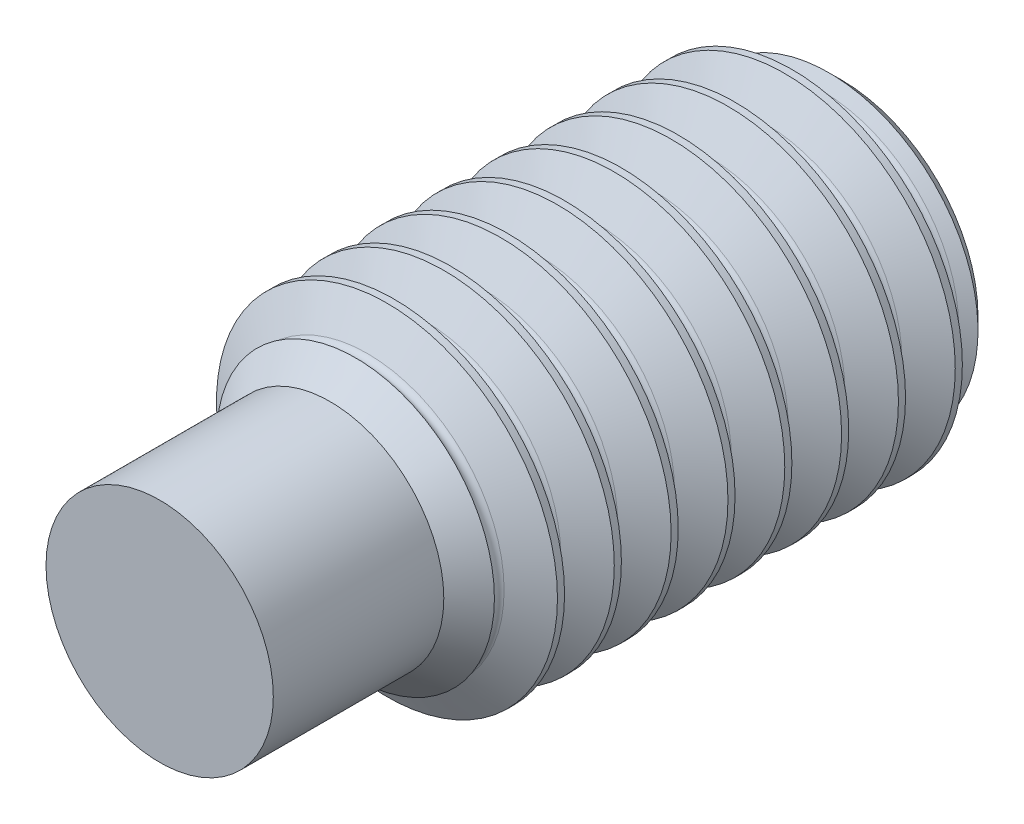
ISO-10303-21;
HEADER;
FILE_DESCRIPTION(('STEP AP214'),'2;1');
FILE_NAME('part.step','',(''),(''),'','','');
FILE_SCHEMA(('AUTOMOTIVE_DESIGN { 1 0 10303 214 1 1 1 1 }'));
ENDSEC;
DATA;
#1=APPLICATION_CONTEXT('core data for automotive mechanical design processes');
#2=APPLICATION_PROTOCOL_DEFINITION('international standard','automotive_design',2000,#1);
#3=PRODUCT_CONTEXT('',#1,'mechanical');
#4=PRODUCT('Part','Part','',(#3));
#5=PRODUCT_RELATED_PRODUCT_CATEGORY('part','',(#4));
#6=PRODUCT_DEFINITION_FORMATION('','',#4);
#7=PRODUCT_DEFINITION_CONTEXT('part definition',#1,'design');
#8=PRODUCT_DEFINITION('design','',#6,#7);
#9=PRODUCT_DEFINITION_SHAPE('','',#8);
#10=(LENGTH_UNIT() NAMED_UNIT(*) SI_UNIT(.MILLI.,.METRE.));
#11=(NAMED_UNIT(*) PLANE_ANGLE_UNIT() SI_UNIT($,.RADIAN.));
#12=(NAMED_UNIT(*) SI_UNIT($,.STERADIAN.) SOLID_ANGLE_UNIT());
#13=UNCERTAINTY_MEASURE_WITH_UNIT(LENGTH_MEASURE(1.E-05),#10,'distance_accuracy_value','');
#14=(GEOMETRIC_REPRESENTATION_CONTEXT(3) GLOBAL_UNCERTAINTY_ASSIGNED_CONTEXT((#13)) GLOBAL_UNIT_ASSIGNED_CONTEXT((#10,
#11,#12)) REPRESENTATION_CONTEXT('',''));
#15=CARTESIAN_POINT('',(0.,0.,0.));
#16=DIRECTION('',(0.,0.,1.));
#17=DIRECTION('',(1.,0.,0.));
#18=AXIS2_PLACEMENT_3D('',#15,#16,#17);
#19=CARTESIAN_POINT('',(0.,1.5,0.));
#20=DIRECTION('',(0.,0.,1.));
#21=DIRECTION('',(1.,0.,0.));
#22=AXIS2_PLACEMENT_3D('',#19,#20,#21);
#23=PLANE('',#22);
#24=CARTESIAN_POINT('',(0.,0.,0.));
#25=DIRECTION('',(0.,0.,1.));
#26=DIRECTION('',(0.,-1.,0.));
#27=AXIS2_PLACEMENT_3D('',#24,#25,#26);
#28=CIRCLE('',#27,1.2);
#29=CARTESIAN_POINT('',(0.,-1.2,0.));
#30=VERTEX_POINT('',#29);
#31=EDGE_CURVE('E11',#30,#30,#28,.T.);
#32=ORIENTED_EDGE('',*,*,#31,.F.);
#33=EDGE_LOOP('',(#32));
#34=FACE_BOUND('',#33,.T.);
#35=DIRECTION('',(-0.5,0.866025403784438,0.));
#36=VECTOR('',#35,1.);
#37=CARTESIAN_POINT('',(0.866025403784439,0.,0.));
#38=LINE('',#37,#36);
#39=CARTESIAN_POINT('',(0.866025403784439,0.,0.));
#40=VERTEX_POINT('',#39);
#41=CARTESIAN_POINT('',(0.433012701892219,0.75,0.));
#42=VERTEX_POINT('',#41);
#43=EDGE_CURVE('E52',#40,#42,#38,.T.);
#44=ORIENTED_EDGE('',*,*,#43,.T.);
#45=DIRECTION('',(-1.,0.,0.));
#46=VECTOR('',#45,1.);
#47=CARTESIAN_POINT('',(0.433012701892219,0.75,0.));
#48=LINE('',#47,#46);
#49=CARTESIAN_POINT('',(-0.433012701892219,0.75,0.));
#50=VERTEX_POINT('',#49);
#51=EDGE_CURVE('E129',#42,#50,#48,.T.);
#52=ORIENTED_EDGE('',*,*,#51,.T.);
#53=DIRECTION('',(-0.5,-0.866025403784439,0.));
#54=VECTOR('',#53,1.);
#55=CARTESIAN_POINT('',(-0.433012701892219,0.75,0.));
#56=LINE('',#55,#54);
#57=CARTESIAN_POINT('',(-0.866025403784439,0.,0.));
#58=VERTEX_POINT('',#57);
#59=EDGE_CURVE('E132',#50,#58,#56,.T.);
#60=ORIENTED_EDGE('',*,*,#59,.T.);
#61=DIRECTION('',(0.5,-0.866025403784438,0.));
#62=VECTOR('',#61,1.);
#63=CARTESIAN_POINT('',(-0.866025403784439,0.,0.));
#64=LINE('',#63,#62);
#65=CARTESIAN_POINT('',(-0.433012701892219,-0.75,0.));
#66=VERTEX_POINT('',#65);
#67=EDGE_CURVE('E135',#58,#66,#64,.T.);
#68=ORIENTED_EDGE('',*,*,#67,.T.);
#69=DIRECTION('',(1.,0.,0.));
#70=VECTOR('',#69,1.);
#71=CARTESIAN_POINT('',(-0.433012701892219,-0.75,0.));
#72=LINE('',#71,#70);
#73=CARTESIAN_POINT('',(0.43301270189222,-0.75,0.));
#74=VERTEX_POINT('',#73);
#75=EDGE_CURVE('E99',#66,#74,#72,.T.);
#76=ORIENTED_EDGE('',*,*,#75,.T.);
#77=DIRECTION('',(0.5,0.866025403784439,0.));
#78=VECTOR('',#77,1.);
#79=CARTESIAN_POINT('',(0.43301270189222,-0.75,0.));
#80=LINE('',#79,#78);
#81=EDGE_CURVE('E94',#74,#40,#80,.T.);
#82=ORIENTED_EDGE('',*,*,#81,.T.);
#83=EDGE_LOOP('',(#44,#52,#60,#68,#76,#82));
#84=FACE_BOUND('',#83,.T.);
#85=ADVANCED_FACE('F37',(#34,#84),#23,.F.);
#86=CARTESIAN_POINT('',(0.,0.,6.));
#87=DIRECTION('',(0.,0.,1.));
#88=DIRECTION('',(1.,0.,0.));
#89=AXIS2_PLACEMENT_3D('',#86,#87,#88);
#90=CYLINDRICAL_SURFACE('',#89,1.5);
#91=CARTESIAN_POINT('',(0.,0.,0.5));
#92=DIRECTION('',(0.,0.,1.));
#93=DIRECTION('',(1.,0.,0.));
#94=AXIS2_PLACEMENT_3D('',#91,#92,#93);
#95=CIRCLE('',#94,1.5);
#96=CARTESIAN_POINT('',(1.5,0.,0.5));
#97=VERTEX_POINT('',#96);
#98=EDGE_CURVE('E222',#97,#97,#95,.T.);
#99=ORIENTED_EDGE('',*,*,#98,.F.);
#100=EDGE_LOOP('',(#99));
#101=FACE_BOUND('',#100,.T.);
#102=CARTESIAN_POINT('',(0.,0.,0.4375));
#103=DIRECTION('',(0.,0.,1.));
#104=DIRECTION('',(1.,0.,0.));
#105=AXIS2_PLACEMENT_3D('',#102,#103,#104);
#106=CIRCLE('',#105,1.5);
#107=CARTESIAN_POINT('',(1.5,0.,0.4375));
#108=VERTEX_POINT('',#107);
#109=EDGE_CURVE('E234',#108,#108,#106,.T.);
#110=ORIENTED_EDGE('',*,*,#109,.T.);
#111=EDGE_LOOP('',(#110));
#112=FACE_BOUND('',#111,.T.);
#113=ADVANCED_FACE('F39',(#101,#112),#90,.T.);
#114=CARTESIAN_POINT('',(0.,0.,0.));
#115=DIRECTION('',(0.,0.,-1.));
#116=DIRECTION('',(-1.,0.,0.));
#117=AXIS2_PLACEMENT_3D('',#114,#115,#116);
#118=CONICAL_SURFACE('',#117,1.5,1.04719755119659);
#119=CARTESIAN_POINT('',(0.,0.,0.171875));
#120=DIRECTION('',(0.,0.,1.));
#121=DIRECTION('',(1.,0.,0.));
#122=AXIS2_PLACEMENT_3D('',#119,#120,#121);
#123=CIRCLE('',#122,1.2023037674491);
#124=CARTESIAN_POINT('',(1.2023037674491,0.,0.171875));
#125=VERTEX_POINT('',#124);
#126=EDGE_CURVE('E231',#125,#125,#123,.T.);
#127=ORIENTED_EDGE('',*,*,#126,.F.);
#128=EDGE_LOOP('',(#127));
#129=FACE_BOUND('',#128,.T.);
#130=CARTESIAN_POINT('',(0.,0.,0.109807621135332));
#131=DIRECTION('',(0.,0.,-1.));
#132=DIRECTION('',(-1.,0.,0.));
#133=AXIS2_PLACEMENT_3D('',#130,#131,#132);
#134=CIRCLE('',#133,1.30980762113533);
#135=CARTESIAN_POINT('',(-1.30980762113533,0.,0.109807621135332));
#136=VERTEX_POINT('',#135);
#137=EDGE_CURVE('E41',#136,#136,#134,.T.);
#138=ORIENTED_EDGE('',*,*,#137,.F.);
#139=EDGE_LOOP('',(#138));
#140=FACE_BOUND('',#139,.T.);
#141=ADVANCED_FACE('F244',(#129,#140),#118,.T.);
#142=CARTESIAN_POINT('',(0.,0.,0.265625));
#143=DIRECTION('',(0.,0.,1.));
#144=DIRECTION('',(1.,0.,0.));
#145=AXIS2_PLACEMENT_3D('',#142,#143,#144);
#146=CONICAL_SURFACE('',#145,1.2023037674491,1.04719755119659);
#147=ORIENTED_EDGE('',*,*,#109,.F.);
#148=EDGE_LOOP('',(#147));
#149=FACE_BOUND('',#148,.T.);
#150=CARTESIAN_POINT('',(0.,0.,0.265625));
#151=DIRECTION('',(0.,0.,1.));
#152=DIRECTION('',(1.,0.,0.));
#153=AXIS2_PLACEMENT_3D('',#150,#151,#152);
#154=CIRCLE('',#153,1.2023037674491);
#155=CARTESIAN_POINT('',(1.2023037674491,0.,0.265625));
#156=VERTEX_POINT('',#155);
#157=EDGE_CURVE('E228',#156,#156,#154,.T.);
#158=ORIENTED_EDGE('',*,*,#157,.T.);
#159=EDGE_LOOP('',(#158));
#160=FACE_BOUND('',#159,.T.);
#161=ADVANCED_FACE('F246',(#149,#160),#146,.T.);
#162=CARTESIAN_POINT('',(0.,0.,0.21875));
#163=DIRECTION('',(0.,0.,1.));
#164=DIRECTION('',(1.,0.,0.));
#165=AXIS2_PLACEMENT_3D('',#162,#163,#164);
#166=TOROIDAL_SURFACE('',#165,1.22936706131736,0.0541265877365273);
#167=ORIENTED_EDGE('',*,*,#157,.F.);
#168=EDGE_LOOP('',(#167));
#169=FACE_BOUND('',#168,.T.);
#170=ORIENTED_EDGE('',*,*,#126,.T.);
#171=EDGE_LOOP('',(#170));
#172=FACE_BOUND('',#171,.T.);
#173=ADVANCED_FACE('F253',(#169,#172),#166,.F.);
#174=CARTESIAN_POINT('',(0.,0.,0.));
#175=DIRECTION('',(0.,0.,1.));
#176=DIRECTION('',(0.,-1.,0.));
#177=AXIS2_PLACEMENT_3D('',#174,#175,#176);
#178=CONICAL_SURFACE('',#177,1.2,0.785398163397442);
#179=ORIENTED_EDGE('',*,*,#137,.T.);
#180=EDGE_LOOP('',(#179));
#181=FACE_BOUND('',#180,.T.);
#182=ORIENTED_EDGE('',*,*,#31,.T.);
#183=EDGE_LOOP('',(#182));
#184=FACE_BOUND('',#183,.T.);
#185=ADVANCED_FACE('F241',(#181,#184),#178,.T.);
#186=CARTESIAN_POINT('',(0.,0.,0.765625));
#187=DIRECTION('',(0.,0.,1.));
#188=DIRECTION('',(1.,0.,0.));
#189=AXIS2_PLACEMENT_3D('',#186,#187,#188);
#190=CONICAL_SURFACE('',#189,1.2023037674491,1.04719755119659);
#191=CARTESIAN_POINT('',(0.,0.,0.9375));
#192=DIRECTION('',(0.,0.,1.));
#193=DIRECTION('',(1.,0.,0.));
#194=AXIS2_PLACEMENT_3D('',#191,#192,#193);
#195=CIRCLE('',#194,1.5);
#196=CARTESIAN_POINT('',(1.5,0.,0.9375));
#197=VERTEX_POINT('',#196);
#198=EDGE_CURVE('E225',#197,#197,#195,.T.);
#199=ORIENTED_EDGE('',*,*,#198,.F.);
#200=EDGE_LOOP('',(#199));
#201=FACE_BOUND('',#200,.T.);
#202=CARTESIAN_POINT('',(0.,0.,0.765625));
#203=DIRECTION('',(0.,0.,1.));
#204=DIRECTION('',(1.,0.,0.));
#205=AXIS2_PLACEMENT_3D('',#202,#203,#204);
#206=CIRCLE('',#205,1.2023037674491);
#207=CARTESIAN_POINT('',(1.2023037674491,0.,0.765625));
#208=VERTEX_POINT('',#207);
#209=EDGE_CURVE('E216',#208,#208,#206,.T.);
#210=ORIENTED_EDGE('',*,*,#209,.T.);
#211=EDGE_LOOP('',(#210));
#212=FACE_BOUND('',#211,.T.);
#213=ADVANCED_FACE('F274',(#201,#212),#190,.T.);
#214=CARTESIAN_POINT('',(0.,0.,0.5));
#215=DIRECTION('',(0.,0.,-1.));
#216=DIRECTION('',(-1.,0.,0.));
#217=AXIS2_PLACEMENT_3D('',#214,#215,#216);
#218=CONICAL_SURFACE('',#217,1.5,1.04719755119659);
#219=CARTESIAN_POINT('',(0.,0.,0.671875));
#220=DIRECTION('',(0.,0.,1.));
#221=DIRECTION('',(1.,0.,0.));
#222=AXIS2_PLACEMENT_3D('',#219,#220,#221);
#223=CIRCLE('',#222,1.2023037674491);
#224=CARTESIAN_POINT('',(1.2023037674491,0.,0.671875));
#225=VERTEX_POINT('',#224);
#226=EDGE_CURVE('E219',#225,#225,#223,.T.);
#227=ORIENTED_EDGE('',*,*,#226,.F.);
#228=EDGE_LOOP('',(#227));
#229=FACE_BOUND('',#228,.T.);
#230=ORIENTED_EDGE('',*,*,#98,.T.);
#231=EDGE_LOOP('',(#230));
#232=FACE_BOUND('',#231,.T.);
#233=ADVANCED_FACE('F279',(#229,#232),#218,.T.);
#234=CARTESIAN_POINT('',(0.,0.,0.71875));
#235=DIRECTION('',(0.,0.,1.));
#236=DIRECTION('',(1.,0.,0.));
#237=AXIS2_PLACEMENT_3D('',#234,#235,#236);
#238=TOROIDAL_SURFACE('',#237,1.22936706131736,0.0541265877365273);
#239=ORIENTED_EDGE('',*,*,#209,.F.);
#240=EDGE_LOOP('',(#239));
#241=FACE_BOUND('',#240,.T.);
#242=ORIENTED_EDGE('',*,*,#226,.T.);
#243=EDGE_LOOP('',(#242));
#244=FACE_BOUND('',#243,.T.);
#245=ADVANCED_FACE('F290',(#241,#244),#238,.F.);
#246=CARTESIAN_POINT('',(0.,0.,1.));
#247=DIRECTION('',(0.,0.,1.));
#248=DIRECTION('',(1.,0.,0.));
#249=AXIS2_PLACEMENT_3D('',#246,#247,#248);
#250=CIRCLE('',#249,1.5);
#251=CARTESIAN_POINT('',(1.5,0.,1.));
#252=VERTEX_POINT('',#251);
#253=EDGE_CURVE('E210',#252,#252,#250,.T.);
#254=ORIENTED_EDGE('',*,*,#253,.F.);
#255=EDGE_LOOP('',(#254));
#256=FACE_BOUND('',#255,.T.);
#257=ORIENTED_EDGE('',*,*,#198,.T.);
#258=EDGE_LOOP('',(#257));
#259=FACE_BOUND('',#258,.T.);
#260=ADVANCED_FACE('F258',(#256,#259),#90,.T.);
#261=CARTESIAN_POINT('',(0.,0.,1.265625));
#262=DIRECTION('',(0.,0.,1.));
#263=DIRECTION('',(1.,0.,0.));
#264=AXIS2_PLACEMENT_3D('',#261,#262,#263);
#265=CONICAL_SURFACE('',#264,1.2023037674491,1.04719755119659);
#266=CARTESIAN_POINT('',(0.,0.,1.4375));
#267=DIRECTION('',(0.,0.,1.));
#268=DIRECTION('',(1.,0.,0.));
#269=AXIS2_PLACEMENT_3D('',#266,#267,#268);
#270=CIRCLE('',#269,1.5);
#271=CARTESIAN_POINT('',(1.5,0.,1.4375));
#272=VERTEX_POINT('',#271);
#273=EDGE_CURVE('E213',#272,#272,#270,.T.);
#274=ORIENTED_EDGE('',*,*,#273,.F.);
#275=EDGE_LOOP('',(#274));
#276=FACE_BOUND('',#275,.T.);
#277=CARTESIAN_POINT('',(0.,0.,1.265625));
#278=DIRECTION('',(0.,0.,1.));
#279=DIRECTION('',(1.,0.,0.));
#280=AXIS2_PLACEMENT_3D('',#277,#278,#279);
#281=CIRCLE('',#280,1.2023037674491);
#282=CARTESIAN_POINT('',(1.2023037674491,0.,1.265625));
#283=VERTEX_POINT('',#282);
#284=EDGE_CURVE('E204',#283,#283,#281,.T.);
#285=ORIENTED_EDGE('',*,*,#284,.T.);
#286=EDGE_LOOP('',(#285));
#287=FACE_BOUND('',#286,.T.);
#288=ADVANCED_FACE('F295',(#276,#287),#265,.T.);
#289=CARTESIAN_POINT('',(0.,0.,1.));
#290=DIRECTION('',(0.,0.,-1.));
#291=DIRECTION('',(-1.,0.,0.));
#292=AXIS2_PLACEMENT_3D('',#289,#290,#291);
#293=CONICAL_SURFACE('',#292,1.5,1.04719755119659);
#294=CARTESIAN_POINT('',(0.,0.,1.171875));
#295=DIRECTION('',(0.,0.,1.));
#296=DIRECTION('',(1.,0.,0.));
#297=AXIS2_PLACEMENT_3D('',#294,#295,#296);
#298=CIRCLE('',#297,1.2023037674491);
#299=CARTESIAN_POINT('',(1.2023037674491,0.,1.171875));
#300=VERTEX_POINT('',#299);
#301=EDGE_CURVE('E207',#300,#300,#298,.T.);
#302=ORIENTED_EDGE('',*,*,#301,.F.);
#303=EDGE_LOOP('',(#302));
#304=FACE_BOUND('',#303,.T.);
#305=ORIENTED_EDGE('',*,*,#253,.T.);
#306=EDGE_LOOP('',(#305));
#307=FACE_BOUND('',#306,.T.);
#308=ADVANCED_FACE('F298',(#304,#307),#293,.T.);
#309=CARTESIAN_POINT('',(0.,0.,1.21875));
#310=DIRECTION('',(0.,0.,1.));
#311=DIRECTION('',(1.,0.,0.));
#312=AXIS2_PLACEMENT_3D('',#309,#310,#311);
#313=TOROIDAL_SURFACE('',#312,1.22936706131736,0.0541265877365273);
#314=ORIENTED_EDGE('',*,*,#284,.F.);
#315=EDGE_LOOP('',(#314));
#316=FACE_BOUND('',#315,.T.);
#317=ORIENTED_EDGE('',*,*,#301,.T.);
#318=EDGE_LOOP('',(#317));
#319=FACE_BOUND('',#318,.T.);
#320=ADVANCED_FACE('F302',(#316,#319),#313,.F.);
#321=CARTESIAN_POINT('',(0.,0.,1.5));
#322=DIRECTION('',(0.,0.,1.));
#323=DIRECTION('',(1.,0.,0.));
#324=AXIS2_PLACEMENT_3D('',#321,#322,#323);
#325=CIRCLE('',#324,1.5);
#326=CARTESIAN_POINT('',(1.5,0.,1.5));
#327=VERTEX_POINT('',#326);
#328=EDGE_CURVE('E198',#327,#327,#325,.T.);
#329=ORIENTED_EDGE('',*,*,#328,.F.);
#330=EDGE_LOOP('',(#329));
#331=FACE_BOUND('',#330,.T.);
#332=ORIENTED_EDGE('',*,*,#273,.T.);
#333=EDGE_LOOP('',(#332));
#334=FACE_BOUND('',#333,.T.);
#335=ADVANCED_FACE('F306',(#331,#334),#90,.T.);
#336=CARTESIAN_POINT('',(0.,0.,1.765625));
#337=DIRECTION('',(0.,0.,1.));
#338=DIRECTION('',(1.,0.,0.));
#339=AXIS2_PLACEMENT_3D('',#336,#337,#338);
#340=CONICAL_SURFACE('',#339,1.2023037674491,1.04719755119659);
#341=CARTESIAN_POINT('',(0.,0.,1.9375));
#342=DIRECTION('',(0.,0.,1.));
#343=DIRECTION('',(1.,0.,0.));
#344=AXIS2_PLACEMENT_3D('',#341,#342,#343);
#345=CIRCLE('',#344,1.5);
#346=CARTESIAN_POINT('',(1.5,0.,1.9375));
#347=VERTEX_POINT('',#346);
#348=EDGE_CURVE('E201',#347,#347,#345,.T.);
#349=ORIENTED_EDGE('',*,*,#348,.F.);
#350=EDGE_LOOP('',(#349));
#351=FACE_BOUND('',#350,.T.);
#352=CARTESIAN_POINT('',(0.,0.,1.765625));
#353=DIRECTION('',(0.,0.,1.));
#354=DIRECTION('',(1.,0.,0.));
#355=AXIS2_PLACEMENT_3D('',#352,#353,#354);
#356=CIRCLE('',#355,1.2023037674491);
#357=CARTESIAN_POINT('',(1.2023037674491,0.,1.765625));
#358=VERTEX_POINT('',#357);
#359=EDGE_CURVE('E192',#358,#358,#356,.T.);
#360=ORIENTED_EDGE('',*,*,#359,.T.);
#361=EDGE_LOOP('',(#360));
#362=FACE_BOUND('',#361,.T.);
#363=ADVANCED_FACE('F308',(#351,#362),#340,.T.);
#364=CARTESIAN_POINT('',(0.,0.,1.5));
#365=DIRECTION('',(0.,0.,-1.));
#366=DIRECTION('',(-1.,0.,0.));
#367=AXIS2_PLACEMENT_3D('',#364,#365,#366);
#368=CONICAL_SURFACE('',#367,1.5,1.04719755119659);
#369=CARTESIAN_POINT('',(0.,0.,1.671875));
#370=DIRECTION('',(0.,0.,1.));
#371=DIRECTION('',(1.,0.,0.));
#372=AXIS2_PLACEMENT_3D('',#369,#370,#371);
#373=CIRCLE('',#372,1.2023037674491);
#374=CARTESIAN_POINT('',(1.2023037674491,0.,1.671875));
#375=VERTEX_POINT('',#374);
#376=EDGE_CURVE('E195',#375,#375,#373,.T.);
#377=ORIENTED_EDGE('',*,*,#376,.F.);
#378=EDGE_LOOP('',(#377));
#379=FACE_BOUND('',#378,.T.);
#380=ORIENTED_EDGE('',*,*,#328,.T.);
#381=EDGE_LOOP('',(#380));
#382=FACE_BOUND('',#381,.T.);
#383=ADVANCED_FACE('F311',(#379,#382),#368,.T.);
#384=CARTESIAN_POINT('',(0.,0.,1.71875));
#385=DIRECTION('',(0.,0.,1.));
#386=DIRECTION('',(1.,0.,0.));
#387=AXIS2_PLACEMENT_3D('',#384,#385,#386);
#388=TOROIDAL_SURFACE('',#387,1.22936706131736,0.0541265877365273);
#389=ORIENTED_EDGE('',*,*,#359,.F.);
#390=EDGE_LOOP('',(#389));
#391=FACE_BOUND('',#390,.T.);
#392=ORIENTED_EDGE('',*,*,#376,.T.);
#393=EDGE_LOOP('',(#392));
#394=FACE_BOUND('',#393,.T.);
#395=ADVANCED_FACE('F315',(#391,#394),#388,.F.);
#396=CARTESIAN_POINT('',(0.,0.,2.));
#397=DIRECTION('',(0.,0.,1.));
#398=DIRECTION('',(1.,0.,0.));
#399=AXIS2_PLACEMENT_3D('',#396,#397,#398);
#400=CIRCLE('',#399,1.5);
#401=CARTESIAN_POINT('',(1.5,0.,2.));
#402=VERTEX_POINT('',#401);
#403=EDGE_CURVE('E186',#402,#402,#400,.T.);
#404=ORIENTED_EDGE('',*,*,#403,.F.);
#405=EDGE_LOOP('',(#404));
#406=FACE_BOUND('',#405,.T.);
#407=ORIENTED_EDGE('',*,*,#348,.T.);
#408=EDGE_LOOP('',(#407));
#409=FACE_BOUND('',#408,.T.);
#410=ADVANCED_FACE('F319',(#406,#409),#90,.T.);
#411=CARTESIAN_POINT('',(0.,0.,2.265625));
#412=DIRECTION('',(0.,0.,1.));
#413=DIRECTION('',(1.,0.,0.));
#414=AXIS2_PLACEMENT_3D('',#411,#412,#413);
#415=CONICAL_SURFACE('',#414,1.2023037674491,1.04719755119659);
#416=CARTESIAN_POINT('',(0.,0.,2.4375));
#417=DIRECTION('',(0.,0.,1.));
#418=DIRECTION('',(1.,0.,0.));
#419=AXIS2_PLACEMENT_3D('',#416,#417,#418);
#420=CIRCLE('',#419,1.5);
#421=CARTESIAN_POINT('',(1.5,0.,2.4375));
#422=VERTEX_POINT('',#421);
#423=EDGE_CURVE('E189',#422,#422,#420,.T.);
#424=ORIENTED_EDGE('',*,*,#423,.F.);
#425=EDGE_LOOP('',(#424));
#426=FACE_BOUND('',#425,.T.);
#427=CARTESIAN_POINT('',(0.,0.,2.265625));
#428=DIRECTION('',(0.,0.,1.));
#429=DIRECTION('',(1.,0.,0.));
#430=AXIS2_PLACEMENT_3D('',#427,#428,#429);
#431=CIRCLE('',#430,1.2023037674491);
#432=CARTESIAN_POINT('',(1.2023037674491,0.,2.265625));
#433=VERTEX_POINT('',#432);
#434=EDGE_CURVE('E180',#433,#433,#431,.T.);
#435=ORIENTED_EDGE('',*,*,#434,.T.);
#436=EDGE_LOOP('',(#435));
#437=FACE_BOUND('',#436,.T.);
#438=ADVANCED_FACE('F321',(#426,#437),#415,.T.);
#439=CARTESIAN_POINT('',(0.,0.,2.));
#440=DIRECTION('',(0.,0.,-1.));
#441=DIRECTION('',(-1.,0.,0.));
#442=AXIS2_PLACEMENT_3D('',#439,#440,#441);
#443=CONICAL_SURFACE('',#442,1.5,1.04719755119659);
#444=CARTESIAN_POINT('',(0.,0.,2.171875));
#445=DIRECTION('',(0.,0.,1.));
#446=DIRECTION('',(1.,0.,0.));
#447=AXIS2_PLACEMENT_3D('',#444,#445,#446);
#448=CIRCLE('',#447,1.2023037674491);
#449=CARTESIAN_POINT('',(1.2023037674491,0.,2.171875));
#450=VERTEX_POINT('',#449);
#451=EDGE_CURVE('E183',#450,#450,#448,.T.);
#452=ORIENTED_EDGE('',*,*,#451,.F.);
#453=EDGE_LOOP('',(#452));
#454=FACE_BOUND('',#453,.T.);
#455=ORIENTED_EDGE('',*,*,#403,.T.);
#456=EDGE_LOOP('',(#455));
#457=FACE_BOUND('',#456,.T.);
#458=ADVANCED_FACE('F324',(#454,#457),#443,.T.);
#459=CARTESIAN_POINT('',(0.,0.,2.21875));
#460=DIRECTION('',(0.,0.,1.));
#461=DIRECTION('',(1.,0.,0.));
#462=AXIS2_PLACEMENT_3D('',#459,#460,#461);
#463=TOROIDAL_SURFACE('',#462,1.22936706131736,0.0541265877365273);
#464=ORIENTED_EDGE('',*,*,#434,.F.);
#465=EDGE_LOOP('',(#464));
#466=FACE_BOUND('',#465,.T.);
#467=ORIENTED_EDGE('',*,*,#451,.T.);
#468=EDGE_LOOP('',(#467));
#469=FACE_BOUND('',#468,.T.);
#470=ADVANCED_FACE('F328',(#466,#469),#463,.F.);
#471=CARTESIAN_POINT('',(0.,0.,2.5));
#472=DIRECTION('',(0.,0.,1.));
#473=DIRECTION('',(1.,0.,0.));
#474=AXIS2_PLACEMENT_3D('',#471,#472,#473);
#475=CIRCLE('',#474,1.5);
#476=CARTESIAN_POINT('',(1.5,0.,2.5));
#477=VERTEX_POINT('',#476);
#478=EDGE_CURVE('E174',#477,#477,#475,.T.);
#479=ORIENTED_EDGE('',*,*,#478,.F.);
#480=EDGE_LOOP('',(#479));
#481=FACE_BOUND('',#480,.T.);
#482=ORIENTED_EDGE('',*,*,#423,.T.);
#483=EDGE_LOOP('',(#482));
#484=FACE_BOUND('',#483,.T.);
#485=ADVANCED_FACE('F332',(#481,#484),#90,.T.);
#486=CARTESIAN_POINT('',(0.,0.,2.765625));
#487=DIRECTION('',(0.,0.,1.));
#488=DIRECTION('',(1.,0.,0.));
#489=AXIS2_PLACEMENT_3D('',#486,#487,#488);
#490=CONICAL_SURFACE('',#489,1.2023037674491,1.04719755119659);
#491=CARTESIAN_POINT('',(0.,0.,2.9375));
#492=DIRECTION('',(0.,0.,1.));
#493=DIRECTION('',(1.,0.,0.));
#494=AXIS2_PLACEMENT_3D('',#491,#492,#493);
#495=CIRCLE('',#494,1.5);
#496=CARTESIAN_POINT('',(1.5,0.,2.9375));
#497=VERTEX_POINT('',#496);
#498=EDGE_CURVE('E177',#497,#497,#495,.T.);
#499=ORIENTED_EDGE('',*,*,#498,.F.);
#500=EDGE_LOOP('',(#499));
#501=FACE_BOUND('',#500,.T.);
#502=CARTESIAN_POINT('',(0.,0.,2.765625));
#503=DIRECTION('',(0.,0.,1.));
#504=DIRECTION('',(1.,0.,0.));
#505=AXIS2_PLACEMENT_3D('',#502,#503,#504);
#506=CIRCLE('',#505,1.2023037674491);
#507=CARTESIAN_POINT('',(1.2023037674491,0.,2.765625));
#508=VERTEX_POINT('',#507);
#509=EDGE_CURVE('E168',#508,#508,#506,.T.);
#510=ORIENTED_EDGE('',*,*,#509,.T.);
#511=EDGE_LOOP('',(#510));
#512=FACE_BOUND('',#511,.T.);
#513=ADVANCED_FACE('F334',(#501,#512),#490,.T.);
#514=CARTESIAN_POINT('',(0.,0.,2.5));
#515=DIRECTION('',(0.,0.,-1.));
#516=DIRECTION('',(-1.,0.,0.));
#517=AXIS2_PLACEMENT_3D('',#514,#515,#516);
#518=CONICAL_SURFACE('',#517,1.5,1.04719755119659);
#519=CARTESIAN_POINT('',(0.,0.,2.671875));
#520=DIRECTION('',(0.,0.,1.));
#521=DIRECTION('',(1.,0.,0.));
#522=AXIS2_PLACEMENT_3D('',#519,#520,#521);
#523=CIRCLE('',#522,1.2023037674491);
#524=CARTESIAN_POINT('',(1.2023037674491,0.,2.671875));
#525=VERTEX_POINT('',#524);
#526=EDGE_CURVE('E171',#525,#525,#523,.T.);
#527=ORIENTED_EDGE('',*,*,#526,.F.);
#528=EDGE_LOOP('',(#527));
#529=FACE_BOUND('',#528,.T.);
#530=ORIENTED_EDGE('',*,*,#478,.T.);
#531=EDGE_LOOP('',(#530));
#532=FACE_BOUND('',#531,.T.);
#533=ADVANCED_FACE('F337',(#529,#532),#518,.T.);
#534=CARTESIAN_POINT('',(0.,0.,2.71875));
#535=DIRECTION('',(0.,0.,1.));
#536=DIRECTION('',(1.,0.,0.));
#537=AXIS2_PLACEMENT_3D('',#534,#535,#536);
#538=TOROIDAL_SURFACE('',#537,1.22936706131736,0.0541265877365273);
#539=ORIENTED_EDGE('',*,*,#509,.F.);
#540=EDGE_LOOP('',(#539));
#541=FACE_BOUND('',#540,.T.);
#542=ORIENTED_EDGE('',*,*,#526,.T.);
#543=EDGE_LOOP('',(#542));
#544=FACE_BOUND('',#543,.T.);
#545=ADVANCED_FACE('F341',(#541,#544),#538,.F.);
#546=CARTESIAN_POINT('',(0.,0.,3.));
#547=DIRECTION('',(0.,0.,1.));
#548=DIRECTION('',(1.,0.,0.));
#549=AXIS2_PLACEMENT_3D('',#546,#547,#548);
#550=CIRCLE('',#549,1.5);
#551=CARTESIAN_POINT('',(1.5,0.,3.));
#552=VERTEX_POINT('',#551);
#553=EDGE_CURVE('E162',#552,#552,#550,.T.);
#554=ORIENTED_EDGE('',*,*,#553,.F.);
#555=EDGE_LOOP('',(#554));
#556=FACE_BOUND('',#555,.T.);
#557=ORIENTED_EDGE('',*,*,#498,.T.);
#558=EDGE_LOOP('',(#557));
#559=FACE_BOUND('',#558,.T.);
#560=ADVANCED_FACE('F345',(#556,#559),#90,.T.);
#561=CARTESIAN_POINT('',(0.,0.,3.265625));
#562=DIRECTION('',(0.,0.,1.));
#563=DIRECTION('',(1.,0.,0.));
#564=AXIS2_PLACEMENT_3D('',#561,#562,#563);
#565=CONICAL_SURFACE('',#564,1.2023037674491,1.04719755119659);
#566=CARTESIAN_POINT('',(0.,0.,3.4375));
#567=DIRECTION('',(0.,0.,1.));
#568=DIRECTION('',(1.,0.,0.));
#569=AXIS2_PLACEMENT_3D('',#566,#567,#568);
#570=CIRCLE('',#569,1.5);
#571=CARTESIAN_POINT('',(1.5,0.,3.4375));
#572=VERTEX_POINT('',#571);
#573=EDGE_CURVE('E165',#572,#572,#570,.T.);
#574=ORIENTED_EDGE('',*,*,#573,.F.);
#575=EDGE_LOOP('',(#574));
#576=FACE_BOUND('',#575,.T.);
#577=CARTESIAN_POINT('',(0.,0.,3.265625));
#578=DIRECTION('',(0.,0.,1.));
#579=DIRECTION('',(1.,0.,0.));
#580=AXIS2_PLACEMENT_3D('',#577,#578,#579);
#581=CIRCLE('',#580,1.2023037674491);
#582=CARTESIAN_POINT('',(1.2023037674491,0.,3.265625));
#583=VERTEX_POINT('',#582);
#584=EDGE_CURVE('E156',#583,#583,#581,.T.);
#585=ORIENTED_EDGE('',*,*,#584,.T.);
#586=EDGE_LOOP('',(#585));
#587=FACE_BOUND('',#586,.T.);
#588=ADVANCED_FACE('F347',(#576,#587),#565,.T.);
#589=CARTESIAN_POINT('',(0.,0.,3.));
#590=DIRECTION('',(0.,0.,-1.));
#591=DIRECTION('',(-1.,0.,0.));
#592=AXIS2_PLACEMENT_3D('',#589,#590,#591);
#593=CONICAL_SURFACE('',#592,1.5,1.04719755119659);
#594=CARTESIAN_POINT('',(0.,0.,3.171875));
#595=DIRECTION('',(0.,0.,1.));
#596=DIRECTION('',(1.,0.,0.));
#597=AXIS2_PLACEMENT_3D('',#594,#595,#596);
#598=CIRCLE('',#597,1.2023037674491);
#599=CARTESIAN_POINT('',(1.2023037674491,0.,3.171875));
#600=VERTEX_POINT('',#599);
#601=EDGE_CURVE('E159',#600,#600,#598,.T.);
#602=ORIENTED_EDGE('',*,*,#601,.F.);
#603=EDGE_LOOP('',(#602));
#604=FACE_BOUND('',#603,.T.);
#605=ORIENTED_EDGE('',*,*,#553,.T.);
#606=EDGE_LOOP('',(#605));
#607=FACE_BOUND('',#606,.T.);
#608=ADVANCED_FACE('F350',(#604,#607),#593,.T.);
#609=CARTESIAN_POINT('',(0.,0.,3.21875));
#610=DIRECTION('',(0.,0.,1.));
#611=DIRECTION('',(1.,0.,0.));
#612=AXIS2_PLACEMENT_3D('',#609,#610,#611);
#613=TOROIDAL_SURFACE('',#612,1.22936706131736,0.0541265877365273);
#614=ORIENTED_EDGE('',*,*,#584,.F.);
#615=EDGE_LOOP('',(#614));
#616=FACE_BOUND('',#615,.T.);
#617=ORIENTED_EDGE('',*,*,#601,.T.);
#618=EDGE_LOOP('',(#617));
#619=FACE_BOUND('',#618,.T.);
#620=ADVANCED_FACE('F354',(#616,#619),#613,.F.);
#621=CARTESIAN_POINT('',(0.,0.,3.5));
#622=DIRECTION('',(0.,0.,1.));
#623=DIRECTION('',(1.,0.,0.));
#624=AXIS2_PLACEMENT_3D('',#621,#622,#623);
#625=CIRCLE('',#624,1.5);
#626=CARTESIAN_POINT('',(1.5,0.,3.5));
#627=VERTEX_POINT('',#626);
#628=EDGE_CURVE('E150',#627,#627,#625,.T.);
#629=ORIENTED_EDGE('',*,*,#628,.F.);
#630=EDGE_LOOP('',(#629));
#631=FACE_BOUND('',#630,.T.);
#632=ORIENTED_EDGE('',*,*,#573,.T.);
#633=EDGE_LOOP('',(#632));
#634=FACE_BOUND('',#633,.T.);
#635=ADVANCED_FACE('F358',(#631,#634),#90,.T.);
#636=CARTESIAN_POINT('',(0.,0.,3.765625));
#637=DIRECTION('',(0.,0.,1.));
#638=DIRECTION('',(1.,0.,0.));
#639=AXIS2_PLACEMENT_3D('',#636,#637,#638);
#640=CONICAL_SURFACE('',#639,1.2023037674491,1.04719755119659);
#641=CARTESIAN_POINT('',(0.,0.,3.9375));
#642=DIRECTION('',(0.,0.,1.));
#643=DIRECTION('',(1.,0.,0.));
#644=AXIS2_PLACEMENT_3D('',#641,#642,#643);
#645=CIRCLE('',#644,1.5);
#646=CARTESIAN_POINT('',(1.5,0.,3.9375));
#647=VERTEX_POINT('',#646);
#648=EDGE_CURVE('E153',#647,#647,#645,.T.);
#649=ORIENTED_EDGE('',*,*,#648,.F.);
#650=EDGE_LOOP('',(#649));
#651=FACE_BOUND('',#650,.T.);
#652=CARTESIAN_POINT('',(0.,0.,3.765625));
#653=DIRECTION('',(0.,0.,1.));
#654=DIRECTION('',(1.,0.,0.));
#655=AXIS2_PLACEMENT_3D('',#652,#653,#654);
#656=CIRCLE('',#655,1.2023037674491);
#657=CARTESIAN_POINT('',(1.2023037674491,0.,3.765625));
#658=VERTEX_POINT('',#657);
#659=EDGE_CURVE('E144',#658,#658,#656,.T.);
#660=ORIENTED_EDGE('',*,*,#659,.T.);
#661=EDGE_LOOP('',(#660));
#662=FACE_BOUND('',#661,.T.);
#663=ADVANCED_FACE('F360',(#651,#662),#640,.T.);
#664=CARTESIAN_POINT('',(0.,0.,3.5));
#665=DIRECTION('',(0.,0.,-1.));
#666=DIRECTION('',(-1.,0.,0.));
#667=AXIS2_PLACEMENT_3D('',#664,#665,#666);
#668=CONICAL_SURFACE('',#667,1.5,1.04719755119659);
#669=CARTESIAN_POINT('',(0.,0.,3.671875));
#670=DIRECTION('',(0.,0.,1.));
#671=DIRECTION('',(1.,0.,0.));
#672=AXIS2_PLACEMENT_3D('',#669,#670,#671);
#673=CIRCLE('',#672,1.2023037674491);
#674=CARTESIAN_POINT('',(1.2023037674491,0.,3.671875));
#675=VERTEX_POINT('',#674);
#676=EDGE_CURVE('E147',#675,#675,#673,.T.);
#677=ORIENTED_EDGE('',*,*,#676,.F.);
#678=EDGE_LOOP('',(#677));
#679=FACE_BOUND('',#678,.T.);
#680=ORIENTED_EDGE('',*,*,#628,.T.);
#681=EDGE_LOOP('',(#680));
#682=FACE_BOUND('',#681,.T.);
#683=ADVANCED_FACE('F363',(#679,#682),#668,.T.);
#684=CARTESIAN_POINT('',(0.,0.,3.71875));
#685=DIRECTION('',(0.,0.,1.));
#686=DIRECTION('',(1.,0.,0.));
#687=AXIS2_PLACEMENT_3D('',#684,#685,#686);
#688=TOROIDAL_SURFACE('',#687,1.22936706131736,0.0541265877365273);
#689=ORIENTED_EDGE('',*,*,#659,.F.);
#690=EDGE_LOOP('',(#689));
#691=FACE_BOUND('',#690,.T.);
#692=ORIENTED_EDGE('',*,*,#676,.T.);
#693=EDGE_LOOP('',(#692));
#694=FACE_BOUND('',#693,.T.);
#695=ADVANCED_FACE('F367',(#691,#694),#688,.F.);
#696=CARTESIAN_POINT('',(0.,0.,4.));
#697=DIRECTION('',(0.,0.,1.));
#698=DIRECTION('',(1.,0.,0.));
#699=AXIS2_PLACEMENT_3D('',#696,#697,#698);
#700=CIRCLE('',#699,1.5);
#701=CARTESIAN_POINT('',(1.5,0.,4.));
#702=VERTEX_POINT('',#701);
#703=EDGE_CURVE('E141',#702,#702,#700,.T.);
#704=ORIENTED_EDGE('',*,*,#703,.F.);
#705=EDGE_LOOP('',(#704));
#706=FACE_BOUND('',#705,.T.);
#707=ORIENTED_EDGE('',*,*,#648,.T.);
#708=EDGE_LOOP('',(#707));
#709=FACE_BOUND('',#708,.T.);
#710=ADVANCED_FACE('F257',(#706,#709),#90,.T.);
#711=CARTESIAN_POINT('',(0.,0.,4.265625));
#712=DIRECTION('',(0.,0.,1.));
#713=DIRECTION('',(1.,0.,0.));
#714=AXIS2_PLACEMENT_3D('',#711,#712,#713);
#715=CONICAL_SURFACE('',#714,1.2023037674491,1.04719755119659);
#716=CARTESIAN_POINT('',(0.,0.,4.27736388584431));
#717=DIRECTION('',(0.,0.,-1.));
#718=DIRECTION('',(-1.,0.,0.));
#719=AXIS2_PLACEMENT_3D('',#716,#717,#718);
#720=CIRCLE('',#719,1.22263611415569);
#721=CARTESIAN_POINT('',(-1.22263611415569,0.,4.27736388584431));
#722=VERTEX_POINT('',#721);
#723=EDGE_CURVE('E137',#722,#722,#720,.T.);
#724=ORIENTED_EDGE('',*,*,#723,.T.);
#725=EDGE_LOOP('',(#724));
#726=FACE_BOUND('',#725,.T.);
#727=CARTESIAN_POINT('',(0.,0.,4.265625));
#728=DIRECTION('',(0.,0.,1.));
#729=DIRECTION('',(1.,0.,0.));
#730=AXIS2_PLACEMENT_3D('',#727,#728,#729);
#731=CIRCLE('',#730,1.2023037674491);
#732=CARTESIAN_POINT('',(1.2023037674491,0.,4.265625));
#733=VERTEX_POINT('',#732);
#734=EDGE_CURVE('E110',#733,#733,#731,.T.);
#735=ORIENTED_EDGE('',*,*,#734,.T.);
#736=EDGE_LOOP('',(#735));
#737=FACE_BOUND('',#736,.T.);
#738=ADVANCED_FACE('F372',(#726,#737),#715,.T.);
#739=CARTESIAN_POINT('',(0.,0.,4.));
#740=DIRECTION('',(0.,0.,-1.));
#741=DIRECTION('',(-1.,0.,0.));
#742=AXIS2_PLACEMENT_3D('',#739,#740,#741);
#743=CONICAL_SURFACE('',#742,1.5,1.04719755119659);
#744=CARTESIAN_POINT('',(0.,0.,4.171875));
#745=DIRECTION('',(0.,0.,1.));
#746=DIRECTION('',(1.,0.,0.));
#747=AXIS2_PLACEMENT_3D('',#744,#745,#746);
#748=CIRCLE('',#747,1.2023037674491);
#749=CARTESIAN_POINT('',(1.2023037674491,0.,4.171875));
#750=VERTEX_POINT('',#749);
#751=EDGE_CURVE('E114',#750,#750,#748,.T.);
#752=ORIENTED_EDGE('',*,*,#751,.F.);
#753=EDGE_LOOP('',(#752));
#754=FACE_BOUND('',#753,.T.);
#755=ORIENTED_EDGE('',*,*,#703,.T.);
#756=EDGE_LOOP('',(#755));
#757=FACE_BOUND('',#756,.T.);
#758=ADVANCED_FACE('F375',(#754,#757),#743,.T.);
#759=CARTESIAN_POINT('',(0.,0.,4.21875));
#760=DIRECTION('',(0.,0.,1.));
#761=DIRECTION('',(1.,0.,0.));
#762=AXIS2_PLACEMENT_3D('',#759,#760,#761);
#763=TOROIDAL_SURFACE('',#762,1.22936706131736,0.0541265877365273);
#764=ORIENTED_EDGE('',*,*,#734,.F.);
#765=EDGE_LOOP('',(#764));
#766=FACE_BOUND('',#765,.T.);
#767=ORIENTED_EDGE('',*,*,#751,.T.);
#768=EDGE_LOOP('',(#767));
#769=FACE_BOUND('',#768,.T.);
#770=ADVANCED_FACE('F379',(#766,#769),#763,.F.);
#771=CARTESIAN_POINT('',(0.866025403784439,0.,3.79128784747792));
#772=DIRECTION('',(-0.866025403784439,-0.5,0.));
#773=DIRECTION('',(0.5,-0.866025403784439,0.));
#774=AXIS2_PLACEMENT_3D('',#771,#772,#773);
#775=PLANE('',#774);
#776=DIRECTION('',(-0.5,0.866025403784439,0.));
#777=VECTOR('',#776,1.);
#778=CARTESIAN_POINT('',(0.866025403784439,0.,1.5));
#779=LINE('',#778,#777);
#780=CARTESIAN_POINT('',(0.866025403784439,0.,1.5));
#781=VERTEX_POINT('',#780);
#782=CARTESIAN_POINT('',(0.433012701892219,0.75,1.5));
#783=VERTEX_POINT('',#782);
#784=EDGE_CURVE('E105',#781,#783,#779,.T.);
#785=ORIENTED_EDGE('',*,*,#784,.T.);
#786=DIRECTION('',(0.,0.,-1.));
#787=VECTOR('',#786,1.);
#788=CARTESIAN_POINT('',(0.433012701892219,0.75,3.79128784747792));
#789=LINE('',#788,#787);
#790=EDGE_CURVE('E127',#783,#42,#789,.T.);
#791=ORIENTED_EDGE('',*,*,#790,.T.);
#792=ORIENTED_EDGE('',*,*,#43,.F.);
#793=DIRECTION('',(0.,0.,-1.));
#794=VECTOR('',#793,1.);
#795=CARTESIAN_POINT('',(0.866025403784439,0.,3.79128784747792));
#796=LINE('',#795,#794);
#797=EDGE_CURVE('E56',#781,#40,#796,.T.);
#798=ORIENTED_EDGE('',*,*,#797,.F.);
#799=EDGE_LOOP('',(#785,#791,#792,#798));
#800=FACE_BOUND('',#799,.T.);
#801=ADVANCED_FACE('F383',(#800),#775,.T.);
#802=CARTESIAN_POINT('',(0.433012701892219,0.75,3.79128784747792));
#803=DIRECTION('',(0.,-1.,0.));
#804=DIRECTION('',(1.,0.,0.));
#805=AXIS2_PLACEMENT_3D('',#802,#803,#804);
#806=PLANE('',#805);
#807=DIRECTION('',(-1.,0.,0.));
#808=VECTOR('',#807,1.);
#809=CARTESIAN_POINT('',(0.433012701892219,0.75,1.5));
#810=LINE('',#809,#808);
#811=CARTESIAN_POINT('',(-0.433012701892219,0.75,1.5));
#812=VERTEX_POINT('',#811);
#813=EDGE_CURVE('E123',#783,#812,#810,.T.);
#814=ORIENTED_EDGE('',*,*,#813,.T.);
#815=DIRECTION('',(0.,0.,-1.));
#816=VECTOR('',#815,1.);
#817=CARTESIAN_POINT('',(-0.433012701892219,0.75,3.79128784747792));
#818=LINE('',#817,#816);
#819=EDGE_CURVE('E130',#812,#50,#818,.T.);
#820=ORIENTED_EDGE('',*,*,#819,.T.);
#821=ORIENTED_EDGE('',*,*,#51,.F.);
#822=ORIENTED_EDGE('',*,*,#790,.F.);
#823=EDGE_LOOP('',(#814,#820,#821,#822));
#824=FACE_BOUND('',#823,.T.);
#825=ADVANCED_FACE('F390',(#824),#806,.T.);
#826=CARTESIAN_POINT('',(-0.433012701892219,0.75,3.79128784747792));
#827=DIRECTION('',(0.866025403784439,-0.5,0.));
#828=DIRECTION('',(0.5,0.866025403784439,0.));
#829=AXIS2_PLACEMENT_3D('',#826,#827,#828);
#830=PLANE('',#829);
#831=DIRECTION('',(-0.5,-0.866025403784439,0.));
#832=VECTOR('',#831,1.);
#833=CARTESIAN_POINT('',(-0.433012701892219,0.75,1.5));
#834=LINE('',#833,#832);
#835=CARTESIAN_POINT('',(-0.866025403784439,0.,1.5));
#836=VERTEX_POINT('',#835);
#837=EDGE_CURVE('E116',#812,#836,#834,.T.);
#838=ORIENTED_EDGE('',*,*,#837,.T.);
#839=DIRECTION('',(0.,0.,-1.));
#840=VECTOR('',#839,1.);
#841=CARTESIAN_POINT('',(-0.866025403784439,0.,3.79128784747792));
#842=LINE('',#841,#840);
#843=EDGE_CURVE('E133',#836,#58,#842,.T.);
#844=ORIENTED_EDGE('',*,*,#843,.T.);
#845=ORIENTED_EDGE('',*,*,#59,.F.);
#846=ORIENTED_EDGE('',*,*,#819,.F.);
#847=EDGE_LOOP('',(#838,#844,#845,#846));
#848=FACE_BOUND('',#847,.T.);
#849=ADVANCED_FACE('F393',(#848),#830,.T.);
#850=CARTESIAN_POINT('',(-0.866025403784439,0.,3.79128784747792));
#851=DIRECTION('',(0.866025403784439,0.5,0.));
#852=DIRECTION('',(-0.5,0.866025403784439,0.));
#853=AXIS2_PLACEMENT_3D('',#850,#851,#852);
#854=PLANE('',#853);
#855=DIRECTION('',(0.5,-0.866025403784439,0.));
#856=VECTOR('',#855,1.);
#857=CARTESIAN_POINT('',(-0.866025403784439,0.,1.5));
#858=LINE('',#857,#856);
#859=CARTESIAN_POINT('',(-0.433012701892219,-0.75,1.5));
#860=VERTEX_POINT('',#859);
#861=EDGE_CURVE('E111',#836,#860,#858,.T.);
#862=ORIENTED_EDGE('',*,*,#861,.T.);
#863=DIRECTION('',(0.,0.,-1.));
#864=VECTOR('',#863,1.);
#865=CARTESIAN_POINT('',(-0.433012701892219,-0.75,3.79128784747792));
#866=LINE('',#865,#864);
#867=EDGE_CURVE('E108',#860,#66,#866,.T.);
#868=ORIENTED_EDGE('',*,*,#867,.T.);
#869=ORIENTED_EDGE('',*,*,#67,.F.);
#870=ORIENTED_EDGE('',*,*,#843,.F.);
#871=EDGE_LOOP('',(#862,#868,#869,#870));
#872=FACE_BOUND('',#871,.T.);
#873=ADVANCED_FACE('F397',(#872),#854,.T.);
#874=CARTESIAN_POINT('',(-0.433012701892219,-0.75,3.79128784747792));
#875=DIRECTION('',(0.,1.,0.));
#876=DIRECTION('',(-1.,0.,0.));
#877=AXIS2_PLACEMENT_3D('',#874,#875,#876);
#878=PLANE('',#877);
#879=DIRECTION('',(1.,0.,0.));
#880=VECTOR('',#879,1.);
#881=CARTESIAN_POINT('',(-0.433012701892219,-0.75,1.5));
#882=LINE('',#881,#880);
#883=CARTESIAN_POINT('',(0.43301270189222,-0.75,1.5));
#884=VERTEX_POINT('',#883);
#885=EDGE_CURVE('E103',#860,#884,#882,.T.);
#886=ORIENTED_EDGE('',*,*,#885,.T.);
#887=DIRECTION('',(0.,0.,-1.));
#888=VECTOR('',#887,1.);
#889=CARTESIAN_POINT('',(0.43301270189222,-0.75,3.79128784747792));
#890=LINE('',#889,#888);
#891=EDGE_CURVE('E89',#884,#74,#890,.T.);
#892=ORIENTED_EDGE('',*,*,#891,.T.);
#893=ORIENTED_EDGE('',*,*,#75,.F.);
#894=ORIENTED_EDGE('',*,*,#867,.F.);
#895=EDGE_LOOP('',(#886,#892,#893,#894));
#896=FACE_BOUND('',#895,.T.);
#897=ADVANCED_FACE('F107',(#896),#878,.T.);
#898=CARTESIAN_POINT('',(0.43301270189222,-0.75,3.79128784747792));
#899=DIRECTION('',(-0.866025403784439,0.5,0.));
#900=DIRECTION('',(-0.5,-0.866025403784439,0.));
#901=AXIS2_PLACEMENT_3D('',#898,#899,#900);
#902=PLANE('',#901);
#903=DIRECTION('',(0.5,0.866025403784439,0.));
#904=VECTOR('',#903,1.);
#905=CARTESIAN_POINT('',(0.43301270189222,-0.75,1.5));
#906=LINE('',#905,#904);
#907=EDGE_CURVE('E92',#884,#781,#906,.T.);
#908=ORIENTED_EDGE('',*,*,#907,.T.);
#909=ORIENTED_EDGE('',*,*,#797,.T.);
#910=ORIENTED_EDGE('',*,*,#81,.F.);
#911=ORIENTED_EDGE('',*,*,#891,.F.);
#912=EDGE_LOOP('',(#908,#909,#910,#911));
#913=FACE_BOUND('',#912,.T.);
#914=ADVANCED_FACE('F91',(#913),#902,.T.);
#915=CARTESIAN_POINT('',(0.,0.,1.5));
#916=DIRECTION('',(0.,0.,1.));
#917=DIRECTION('',(1.,0.,0.));
#918=AXIS2_PLACEMENT_3D('',#915,#916,#917);
#919=PLANE('',#918);
#920=ORIENTED_EDGE('',*,*,#907,.F.);
#921=ORIENTED_EDGE('',*,*,#885,.F.);
#922=ORIENTED_EDGE('',*,*,#861,.F.);
#923=ORIENTED_EDGE('',*,*,#837,.F.);
#924=ORIENTED_EDGE('',*,*,#813,.F.);
#925=ORIENTED_EDGE('',*,*,#784,.F.);
#926=EDGE_LOOP('',(#920,#921,#922,#923,#924,#925));
#927=FACE_BOUND('',#926,.T.);
#928=ADVANCED_FACE('F102',(#927),#919,.F.);
#929=CARTESIAN_POINT('',(0.,0.,4.));
#930=DIRECTION('',(0.,0.,-1.));
#931=DIRECTION('',(-1.,0.,0.));
#932=AXIS2_PLACEMENT_3D('',#929,#930,#931);
#933=CONICAL_SURFACE('',#932,1.5,0.785398163397449);
#934=CARTESIAN_POINT('',(0.,0.,4.5));
#935=DIRECTION('',(0.,0.,1.));
#936=DIRECTION('',(1.,0.,0.));
#937=AXIS2_PLACEMENT_3D('',#934,#935,#936);
#938=CIRCLE('',#937,1.);
#939=CARTESIAN_POINT('',(1.,0.,4.5));
#940=VERTEX_POINT('',#939);
#941=EDGE_CURVE('E416',#940,#940,#938,.T.);
#942=ORIENTED_EDGE('',*,*,#941,.F.);
#943=EDGE_LOOP('',(#942));
#944=FACE_BOUND('',#943,.T.);
#945=ORIENTED_EDGE('',*,*,#723,.F.);
#946=EDGE_LOOP('',(#945));
#947=FACE_BOUND('',#946,.T.);
#948=ADVANCED_FACE('F387',(#944,#947),#933,.T.);
#949=CARTESIAN_POINT('',(0.,0.,6.));
#950=DIRECTION('',(0.,0.,1.));
#951=DIRECTION('',(1.,0.,0.));
#952=AXIS2_PLACEMENT_3D('',#949,#950,#951);
#953=CYLINDRICAL_SURFACE('',#952,1.);
#954=CARTESIAN_POINT('',(0.,0.,6.));
#955=DIRECTION('',(0.,0.,1.));
#956=DIRECTION('',(1.,0.,0.));
#957=AXIS2_PLACEMENT_3D('',#954,#955,#956);
#958=CIRCLE('',#957,1.);
#959=CARTESIAN_POINT('',(1.,0.,6.));
#960=VERTEX_POINT('',#959);
#961=EDGE_CURVE('E419',#960,#960,#958,.T.);
#962=ORIENTED_EDGE('',*,*,#961,.F.);
#963=EDGE_LOOP('',(#962));
#964=FACE_BOUND('',#963,.T.);
#965=ORIENTED_EDGE('',*,*,#941,.T.);
#966=EDGE_LOOP('',(#965));
#967=FACE_BOUND('',#966,.T.);
#968=ADVANCED_FACE('F271',(#964,#967),#953,.T.);
#969=CARTESIAN_POINT('',(0.,1.5,6.));
#970=DIRECTION('',(0.,0.,-1.));
#971=DIRECTION('',(-1.,0.,0.));
#972=AXIS2_PLACEMENT_3D('',#969,#970,#971);
#973=PLANE('',#972);
#974=ORIENTED_EDGE('',*,*,#961,.T.);
#975=EDGE_LOOP('',(#974));
#976=FACE_BOUND('',#975,.T.);
#977=ADVANCED_FACE('F268',(#976),#973,.F.);
#978=CLOSED_SHELL('',(#85,#113,#141,#161,#173,#185,#213,#233,#245,#260,#288,#308,#320,#335,#363,
#383,#395,#410,#438,#458,#470,#485,#513,#533,#545,#560,#588,#608,#620,#635,#663,#683,#695,#710,
#738,#758,#770,#801,#825,#849,#873,#897,#914,#928,#948,#968,#977));
#979=MANIFOLD_SOLID_BREP('B2',#978);
#980=ADVANCED_BREP_SHAPE_REPRESENTATION('',(#18,#979),#14);
#981=SHAPE_DEFINITION_REPRESENTATION(#9,#980);
ENDSEC;
END-ISO-10303-21;
